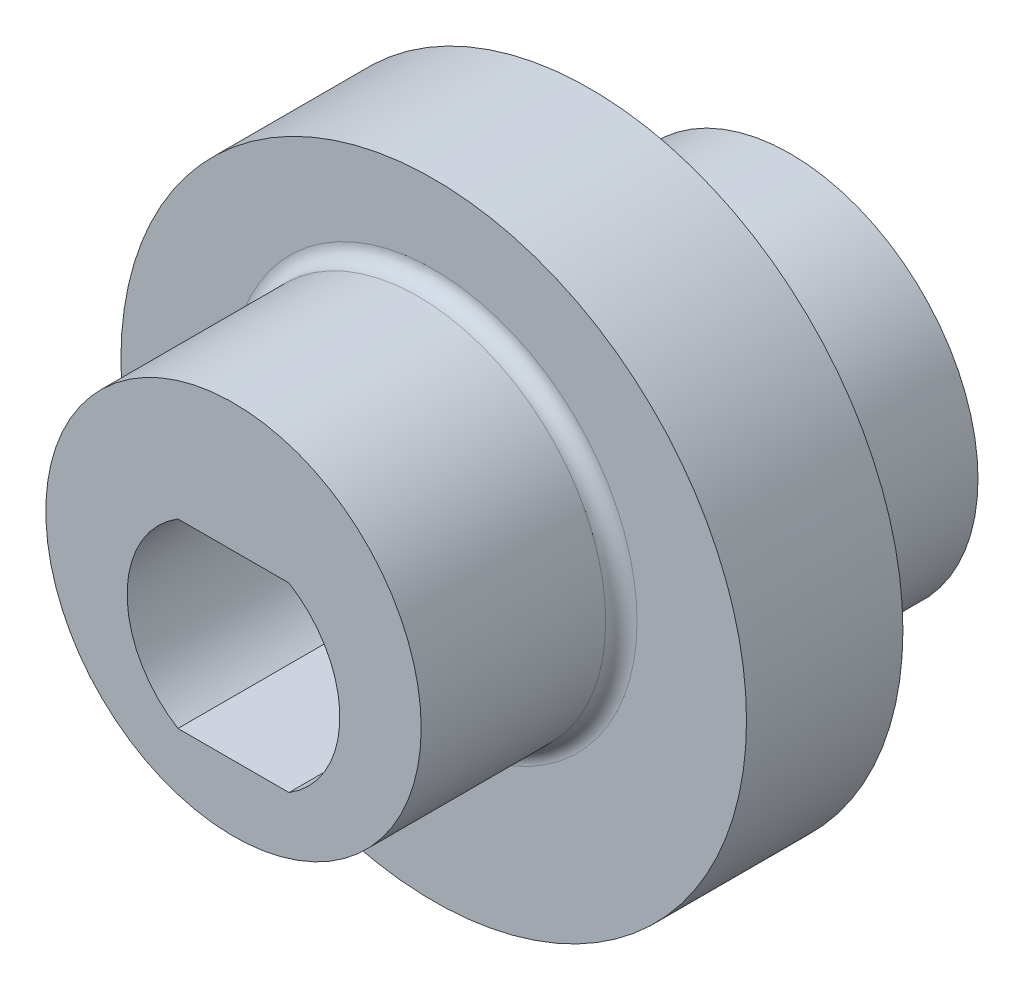
ISO-10303-21;
HEADER;
FILE_DESCRIPTION(('STEP AP214'),'2;1');
FILE_NAME('part.step','',(''),(''),'','','');
FILE_SCHEMA(('AUTOMOTIVE_DESIGN { 1 0 10303 214 1 1 1 1 }'));
ENDSEC;
DATA;
#1=APPLICATION_CONTEXT('core data for automotive mechanical design processes');
#2=APPLICATION_PROTOCOL_DEFINITION('international standard','automotive_design',2000,#1);
#3=PRODUCT_CONTEXT('',#1,'mechanical');
#4=PRODUCT('Part','Part','',(#3));
#5=PRODUCT_RELATED_PRODUCT_CATEGORY('part','',(#4));
#6=PRODUCT_DEFINITION_FORMATION('','',#4);
#7=PRODUCT_DEFINITION_CONTEXT('part definition',#1,'design');
#8=PRODUCT_DEFINITION('design','',#6,#7);
#9=PRODUCT_DEFINITION_SHAPE('','',#8);
#10=(LENGTH_UNIT() NAMED_UNIT(*) SI_UNIT(.MILLI.,.METRE.));
#11=(NAMED_UNIT(*) PLANE_ANGLE_UNIT() SI_UNIT($,.RADIAN.));
#12=(NAMED_UNIT(*) SI_UNIT($,.STERADIAN.) SOLID_ANGLE_UNIT());
#13=UNCERTAINTY_MEASURE_WITH_UNIT(LENGTH_MEASURE(1.E-05),#10,'distance_accuracy_value','');
#14=(GEOMETRIC_REPRESENTATION_CONTEXT(3) GLOBAL_UNCERTAINTY_ASSIGNED_CONTEXT((#13)) GLOBAL_UNIT_ASSIGNED_CONTEXT((#10,
#11,#12)) REPRESENTATION_CONTEXT('',''));
#15=CARTESIAN_POINT('',(0.,0.,0.));
#16=DIRECTION('',(0.,0.,1.));
#17=DIRECTION('',(1.,0.,0.));
#18=AXIS2_PLACEMENT_3D('',#15,#16,#17);
#19=CARTESIAN_POINT('',(0.,0.,2.5));
#20=DIRECTION('',(0.,0.,-1.));
#21=DIRECTION('',(-1.,0.,0.));
#22=AXIS2_PLACEMENT_3D('',#19,#20,#21);
#23=CYLINDRICAL_SURFACE('',#22,10.);
#24=CARTESIAN_POINT('',(0.,0.,2.5));
#25=DIRECTION('',(0.,0.,1.));
#26=DIRECTION('',(1.,0.,0.));
#27=AXIS2_PLACEMENT_3D('',#24,#25,#26);
#28=CIRCLE('',#27,10.);
#29=CARTESIAN_POINT('',(10.,0.,2.5));
#30=VERTEX_POINT('',#29);
#31=EDGE_CURVE('E142',#30,#30,#28,.T.);
#32=ORIENTED_EDGE('',*,*,#31,.F.);
#33=EDGE_LOOP('',(#32));
#34=FACE_BOUND('',#33,.T.);
#35=CARTESIAN_POINT('',(0.,0.,-2.5));
#36=DIRECTION('',(0.,0.,1.));
#37=DIRECTION('',(1.,0.,0.));
#38=AXIS2_PLACEMENT_3D('',#35,#36,#37);
#39=CIRCLE('',#38,10.);
#40=CARTESIAN_POINT('',(10.,0.,-2.5));
#41=VERTEX_POINT('',#40);
#42=EDGE_CURVE('E141',#41,#41,#39,.T.);
#43=ORIENTED_EDGE('',*,*,#42,.T.);
#44=EDGE_LOOP('',(#43));
#45=FACE_BOUND('',#44,.T.);
#46=ADVANCED_FACE('F44',(#34,#45),#23,.T.);
#47=CARTESIAN_POINT('',(0.,0.,2.5));
#48=DIRECTION('',(0.,0.,1.));
#49=DIRECTION('',(1.,0.,0.));
#50=AXIS2_PLACEMENT_3D('',#47,#48,#49);
#51=PLANE('',#50);
#52=CARTESIAN_POINT('',(0.,1.,2.5));
#53=DIRECTION('',(0.,0.,1.));
#54=DIRECTION('',(1.,0.,0.));
#55=AXIS2_PLACEMENT_3D('',#52,#53,#54);
#56=CIRCLE('',#55,6.5);
#57=CARTESIAN_POINT('',(6.5,1.,2.5));
#58=VERTEX_POINT('',#57);
#59=EDGE_CURVE('E153',#58,#58,#56,.F.);
#60=ORIENTED_EDGE('',*,*,#59,.T.);
#61=EDGE_LOOP('',(#60));
#62=FACE_BOUND('',#61,.T.);
#63=ORIENTED_EDGE('',*,*,#31,.T.);
#64=EDGE_LOOP('',(#63));
#65=FACE_BOUND('',#64,.T.);
#66=ADVANCED_FACE('F172',(#62,#65),#51,.T.);
#67=CARTESIAN_POINT('',(0.,0.,-2.5));
#68=DIRECTION('',(0.,0.,1.));
#69=DIRECTION('',(1.,0.,0.));
#70=AXIS2_PLACEMENT_3D('',#67,#68,#69);
#71=PLANE('',#70);
#72=CARTESIAN_POINT('',(0.,-1.,-2.5));
#73=DIRECTION('',(0.,0.,1.));
#74=DIRECTION('',(1.,0.,0.));
#75=AXIS2_PLACEMENT_3D('',#72,#73,#74);
#76=CIRCLE('',#75,6.5);
#77=CARTESIAN_POINT('',(6.5,-1.,-2.5));
#78=VERTEX_POINT('',#77);
#79=EDGE_CURVE('E11',#78,#78,#76,.T.);
#80=ORIENTED_EDGE('',*,*,#79,.T.);
#81=EDGE_LOOP('',(#80));
#82=FACE_BOUND('',#81,.T.);
#83=ORIENTED_EDGE('',*,*,#42,.F.);
#84=EDGE_LOOP('',(#83));
#85=FACE_BOUND('',#84,.T.);
#86=ADVANCED_FACE('F179',(#82,#85),#71,.F.);
#87=CARTESIAN_POINT('',(0.,1.,8.9));
#88=DIRECTION('',(0.,0.,-1.));
#89=DIRECTION('',(-1.,0.,0.));
#90=AXIS2_PLACEMENT_3D('',#87,#88,#89);
#91=CYLINDRICAL_SURFACE('',#90,6.);
#92=CARTESIAN_POINT('',(0.,1.,3.));
#93=DIRECTION('',(0.,0.,1.));
#94=DIRECTION('',(1.,0.,0.));
#95=AXIS2_PLACEMENT_3D('',#92,#93,#94);
#96=CIRCLE('',#95,6.);
#97=CARTESIAN_POINT('',(6.,1.,3.));
#98=VERTEX_POINT('',#97);
#99=EDGE_CURVE('E146',#98,#98,#96,.T.);
#100=ORIENTED_EDGE('',*,*,#99,.T.);
#101=EDGE_LOOP('',(#100));
#102=FACE_BOUND('',#101,.T.);
#103=CARTESIAN_POINT('',(0.,1.,8.9));
#104=DIRECTION('',(0.,0.,1.));
#105=DIRECTION('',(1.,0.,0.));
#106=AXIS2_PLACEMENT_3D('',#103,#104,#105);
#107=CIRCLE('',#106,6.);
#108=CARTESIAN_POINT('',(6.,1.,8.9));
#109=VERTEX_POINT('',#108);
#110=EDGE_CURVE('E137',#109,#109,#107,.T.);
#111=ORIENTED_EDGE('',*,*,#110,.F.);
#112=EDGE_LOOP('',(#111));
#113=FACE_BOUND('',#112,.T.);
#114=ADVANCED_FACE('F186',(#102,#113),#91,.T.);
#115=CARTESIAN_POINT('',(0.,1.,8.9));
#116=DIRECTION('',(0.,0.,1.));
#117=DIRECTION('',(1.,0.,0.));
#118=AXIS2_PLACEMENT_3D('',#115,#116,#117);
#119=PLANE('',#118);
#120=CARTESIAN_POINT('',(0.,0.,8.9));
#121=DIRECTION('',(0.,0.,1.));
#122=DIRECTION('',(1.,0.,0.));
#123=AXIS2_PLACEMENT_3D('',#120,#121,#122);
#124=CIRCLE('',#123,3.4);
#125=CARTESIAN_POINT('',(-1.77482393492988,2.9,8.9));
#126=VERTEX_POINT('',#125);
#127=CARTESIAN_POINT('',(-1.77482393492988,-2.9,8.9));
#128=VERTEX_POINT('',#127);
#129=EDGE_CURVE('E60',#126,#128,#124,.T.);
#130=ORIENTED_EDGE('',*,*,#129,.F.);
#131=DIRECTION('',(-1.,0.,0.));
#132=VECTOR('',#131,1.);
#133=CARTESIAN_POINT('',(-1.77482393492988,2.9,8.9));
#134=LINE('',#133,#132);
#135=CARTESIAN_POINT('',(1.77482393492989,2.9,8.9));
#136=VERTEX_POINT('',#135);
#137=EDGE_CURVE('E106',#136,#126,#134,.T.);
#138=ORIENTED_EDGE('',*,*,#137,.F.);
#139=CARTESIAN_POINT('',(0.,0.,8.9));
#140=DIRECTION('',(0.,0.,1.));
#141=DIRECTION('',(1.,0.,0.));
#142=AXIS2_PLACEMENT_3D('',#139,#140,#141);
#143=CIRCLE('',#142,3.4);
#144=CARTESIAN_POINT('',(1.77482393492988,-2.9,8.9));
#145=VERTEX_POINT('',#144);
#146=EDGE_CURVE('E88',#145,#136,#143,.T.);
#147=ORIENTED_EDGE('',*,*,#146,.F.);
#148=DIRECTION('',(1.,0.,0.));
#149=VECTOR('',#148,1.);
#150=CARTESIAN_POINT('',(-1.77482393492988,-2.9,8.9));
#151=LINE('',#150,#149);
#152=EDGE_CURVE('E98',#128,#145,#151,.T.);
#153=ORIENTED_EDGE('',*,*,#152,.F.);
#154=EDGE_LOOP('',(#130,#138,#147,#153));
#155=FACE_BOUND('',#154,.T.);
#156=ORIENTED_EDGE('',*,*,#110,.T.);
#157=EDGE_LOOP('',(#156));
#158=FACE_BOUND('',#157,.T.);
#159=ADVANCED_FACE('F103',(#155,#158),#119,.T.);
#160=CARTESIAN_POINT('',(0.,-1.,-8.9));
#161=DIRECTION('',(0.,0.,1.));
#162=DIRECTION('',(1.,0.,0.));
#163=AXIS2_PLACEMENT_3D('',#160,#161,#162);
#164=CYLINDRICAL_SURFACE('',#163,6.);
#165=CARTESIAN_POINT('',(0.,-1.,-3.));
#166=DIRECTION('',(0.,0.,1.));
#167=DIRECTION('',(1.,0.,0.));
#168=AXIS2_PLACEMENT_3D('',#165,#166,#167);
#169=CIRCLE('',#168,6.);
#170=CARTESIAN_POINT('',(6.,-1.,-3.));
#171=VERTEX_POINT('',#170);
#172=EDGE_CURVE('E53',#171,#171,#169,.F.);
#173=ORIENTED_EDGE('',*,*,#172,.T.);
#174=EDGE_LOOP('',(#173));
#175=FACE_BOUND('',#174,.T.);
#176=CARTESIAN_POINT('',(0.,-1.,-8.9));
#177=DIRECTION('',(0.,0.,-1.));
#178=DIRECTION('',(-1.,0.,0.));
#179=AXIS2_PLACEMENT_3D('',#176,#177,#178);
#180=CIRCLE('',#179,6.);
#181=CARTESIAN_POINT('',(-6.,-1.,-8.9));
#182=VERTEX_POINT('',#181);
#183=EDGE_CURVE('E129',#182,#182,#180,.T.);
#184=ORIENTED_EDGE('',*,*,#183,.F.);
#185=EDGE_LOOP('',(#184));
#186=FACE_BOUND('',#185,.T.);
#187=ADVANCED_FACE('F160',(#175,#186),#164,.T.);
#188=CARTESIAN_POINT('',(0.,-1.,-8.9));
#189=DIRECTION('',(0.,0.,-1.));
#190=DIRECTION('',(-1.,0.,0.));
#191=AXIS2_PLACEMENT_3D('',#188,#189,#190);
#192=PLANE('',#191);
#193=CARTESIAN_POINT('',(0.,0.,-8.9));
#194=DIRECTION('',(0.,0.,1.));
#195=DIRECTION('',(1.,0.,0.));
#196=AXIS2_PLACEMENT_3D('',#193,#194,#195);
#197=CIRCLE('',#196,3.4);
#198=CARTESIAN_POINT('',(-1.77482393492988,2.9,-8.9));
#199=VERTEX_POINT('',#198);
#200=CARTESIAN_POINT('',(-1.77482393492988,-2.9,-8.9));
#201=VERTEX_POINT('',#200);
#202=EDGE_CURVE('E110',#199,#201,#197,.T.);
#203=ORIENTED_EDGE('',*,*,#202,.T.);
#204=DIRECTION('',(1.,0.,0.));
#205=VECTOR('',#204,1.);
#206=CARTESIAN_POINT('',(-1.77482393492988,-2.9,-8.9));
#207=LINE('',#206,#205);
#208=CARTESIAN_POINT('',(1.77482393492988,-2.9,-8.9));
#209=VERTEX_POINT('',#208);
#210=EDGE_CURVE('E117',#201,#209,#207,.T.);
#211=ORIENTED_EDGE('',*,*,#210,.T.);
#212=CARTESIAN_POINT('',(0.,0.,-8.9));
#213=DIRECTION('',(0.,0.,1.));
#214=DIRECTION('',(1.,0.,0.));
#215=AXIS2_PLACEMENT_3D('',#212,#213,#214);
#216=CIRCLE('',#215,3.4);
#217=CARTESIAN_POINT('',(1.77482393492989,2.9,-8.9));
#218=VERTEX_POINT('',#217);
#219=EDGE_CURVE('E68',#209,#218,#216,.T.);
#220=ORIENTED_EDGE('',*,*,#219,.T.);
#221=DIRECTION('',(-1.,0.,0.));
#222=VECTOR('',#221,1.);
#223=CARTESIAN_POINT('',(-1.77482393492988,2.9,-8.9));
#224=LINE('',#223,#222);
#225=EDGE_CURVE('E122',#218,#199,#224,.T.);
#226=ORIENTED_EDGE('',*,*,#225,.T.);
#227=EDGE_LOOP('',(#203,#211,#220,#226));
#228=FACE_BOUND('',#227,.T.);
#229=ORIENTED_EDGE('',*,*,#183,.T.);
#230=EDGE_LOOP('',(#229));
#231=FACE_BOUND('',#230,.T.);
#232=ADVANCED_FACE('F195',(#228,#231),#192,.T.);
#233=CARTESIAN_POINT('',(0.,0.,-8.9));
#234=DIRECTION('',(0.,0.,1.));
#235=DIRECTION('',(1.,0.,0.));
#236=AXIS2_PLACEMENT_3D('',#233,#234,#235);
#237=CYLINDRICAL_SURFACE('',#236,3.4);
#238=DIRECTION('',(0.,0.,1.));
#239=VECTOR('',#238,1.);
#240=CARTESIAN_POINT('',(-1.77482393492988,-2.9,-8.9));
#241=LINE('',#240,#239);
#242=EDGE_CURVE('E95',#201,#128,#241,.T.);
#243=ORIENTED_EDGE('',*,*,#242,.F.);
#244=ORIENTED_EDGE('',*,*,#202,.F.);
#245=DIRECTION('',(0.,0.,1.));
#246=VECTOR('',#245,1.);
#247=CARTESIAN_POINT('',(-1.77482393492988,2.9,-8.9));
#248=LINE('',#247,#246);
#249=EDGE_CURVE('E126',#199,#126,#248,.T.);
#250=ORIENTED_EDGE('',*,*,#249,.T.);
#251=ORIENTED_EDGE('',*,*,#129,.T.);
#252=EDGE_LOOP('',(#243,#244,#250,#251));
#253=FACE_BOUND('',#252,.T.);
#254=ADVANCED_FACE('F198',(#253),#237,.F.);
#255=CARTESIAN_POINT('',(-1.77482393492988,2.9,-8.9));
#256=DIRECTION('',(0.,1.,0.));
#257=DIRECTION('',(-1.,0.,0.));
#258=AXIS2_PLACEMENT_3D('',#255,#256,#257);
#259=PLANE('',#258);
#260=ORIENTED_EDGE('',*,*,#249,.F.);
#261=ORIENTED_EDGE('',*,*,#225,.F.);
#262=DIRECTION('',(0.,0.,1.));
#263=VECTOR('',#262,1.);
#264=CARTESIAN_POINT('',(1.77482393492989,2.9,-8.9));
#265=LINE('',#264,#263);
#266=EDGE_CURVE('E94',#218,#136,#265,.T.);
#267=ORIENTED_EDGE('',*,*,#266,.T.);
#268=ORIENTED_EDGE('',*,*,#137,.T.);
#269=EDGE_LOOP('',(#260,#261,#267,#268));
#270=FACE_BOUND('',#269,.T.);
#271=ADVANCED_FACE('F202',(#270),#259,.F.);
#272=CARTESIAN_POINT('',(0.,0.,-8.9));
#273=DIRECTION('',(0.,0.,1.));
#274=DIRECTION('',(1.,0.,0.));
#275=AXIS2_PLACEMENT_3D('',#272,#273,#274);
#276=CYLINDRICAL_SURFACE('',#275,3.4);
#277=ORIENTED_EDGE('',*,*,#266,.F.);
#278=ORIENTED_EDGE('',*,*,#219,.F.);
#279=DIRECTION('',(0.,0.,1.));
#280=VECTOR('',#279,1.);
#281=CARTESIAN_POINT('',(1.77482393492988,-2.9,-8.9));
#282=LINE('',#281,#280);
#283=EDGE_CURVE('E84',#209,#145,#282,.T.);
#284=ORIENTED_EDGE('',*,*,#283,.T.);
#285=ORIENTED_EDGE('',*,*,#146,.T.);
#286=EDGE_LOOP('',(#277,#278,#284,#285));
#287=FACE_BOUND('',#286,.T.);
#288=ADVANCED_FACE('F86',(#287),#276,.F.);
#289=CARTESIAN_POINT('',(-1.77482393492988,-2.9,-8.9));
#290=DIRECTION('',(0.,-1.,0.));
#291=DIRECTION('',(0.,0.,-1.));
#292=AXIS2_PLACEMENT_3D('',#289,#290,#291);
#293=PLANE('',#292);
#294=ORIENTED_EDGE('',*,*,#283,.F.);
#295=ORIENTED_EDGE('',*,*,#210,.F.);
#296=ORIENTED_EDGE('',*,*,#242,.T.);
#297=ORIENTED_EDGE('',*,*,#152,.T.);
#298=EDGE_LOOP('',(#294,#295,#296,#297));
#299=FACE_BOUND('',#298,.T.);
#300=ADVANCED_FACE('F99',(#299),#293,.F.);
#301=CARTESIAN_POINT('',(0.,1.,3.));
#302=DIRECTION('',(0.,0.,1.));
#303=DIRECTION('',(1.,0.,0.));
#304=AXIS2_PLACEMENT_3D('',#301,#302,#303);
#305=TOROIDAL_SURFACE('',#304,6.5,0.5);
#306=ORIENTED_EDGE('',*,*,#59,.F.);
#307=EDGE_LOOP('',(#306));
#308=FACE_BOUND('',#307,.T.);
#309=ORIENTED_EDGE('',*,*,#99,.F.);
#310=EDGE_LOOP('',(#309));
#311=FACE_BOUND('',#310,.T.);
#312=ADVANCED_FACE('F164',(#308,#311),#305,.F.);
#313=CARTESIAN_POINT('',(0.,-1.,-3.));
#314=DIRECTION('',(0.,0.,1.));
#315=DIRECTION('',(1.,0.,0.));
#316=AXIS2_PLACEMENT_3D('',#313,#314,#315);
#317=TOROIDAL_SURFACE('',#316,6.5,0.5);
#318=ORIENTED_EDGE('',*,*,#79,.F.);
#319=EDGE_LOOP('',(#318));
#320=FACE_BOUND('',#319,.T.);
#321=ORIENTED_EDGE('',*,*,#172,.F.);
#322=EDGE_LOOP('',(#321));
#323=FACE_BOUND('',#322,.T.);
#324=ADVANCED_FACE('F46',(#320,#323),#317,.F.);
#325=CLOSED_SHELL('',(#46,#66,#86,#114,#159,#187,#232,#254,#271,#288,#300,#312,#324));
#326=MANIFOLD_SOLID_BREP('B2',#325);
#327=ADVANCED_BREP_SHAPE_REPRESENTATION('',(#18,#326),#14);
#328=SHAPE_DEFINITION_REPRESENTATION(#9,#327);
ENDSEC;
END-ISO-10303-21;
